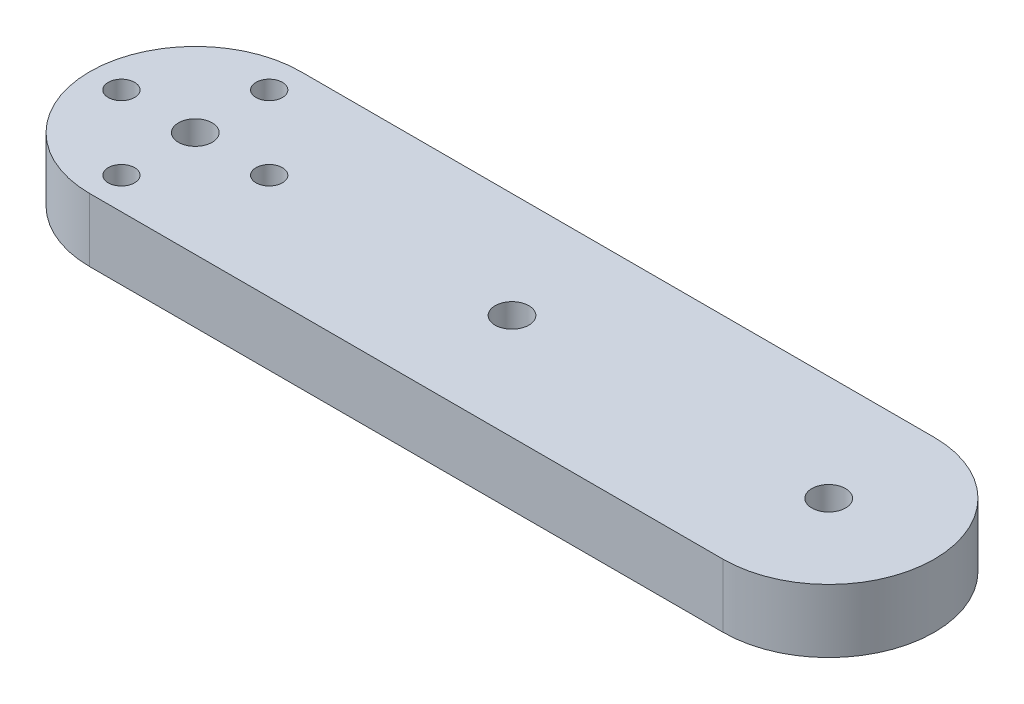
ISO-10303-21;
HEADER;
FILE_DESCRIPTION(('STEP AP214'),'2;1');
FILE_NAME('part.step','',(''),(''),'','','');
FILE_SCHEMA(('AUTOMOTIVE_DESIGN { 1 0 10303 214 1 1 1 1 }'));
ENDSEC;
DATA;
#1=APPLICATION_CONTEXT('core data for automotive mechanical design processes');
#2=APPLICATION_PROTOCOL_DEFINITION('international standard','automotive_design',2000,#1);
#3=PRODUCT_CONTEXT('',#1,'mechanical');
#4=PRODUCT('Part','Part','',(#3));
#5=PRODUCT_RELATED_PRODUCT_CATEGORY('part','',(#4));
#6=PRODUCT_DEFINITION_FORMATION('','',#4);
#7=PRODUCT_DEFINITION_CONTEXT('part definition',#1,'design');
#8=PRODUCT_DEFINITION('design','',#6,#7);
#9=PRODUCT_DEFINITION_SHAPE('','',#8);
#10=(LENGTH_UNIT() NAMED_UNIT(*) SI_UNIT(.MILLI.,.METRE.));
#11=(NAMED_UNIT(*) PLANE_ANGLE_UNIT() SI_UNIT($,.RADIAN.));
#12=(NAMED_UNIT(*) SI_UNIT($,.STERADIAN.) SOLID_ANGLE_UNIT());
#13=UNCERTAINTY_MEASURE_WITH_UNIT(LENGTH_MEASURE(1.E-05),#10,'distance_accuracy_value','');
#14=(GEOMETRIC_REPRESENTATION_CONTEXT(3) GLOBAL_UNCERTAINTY_ASSIGNED_CONTEXT((#13)) GLOBAL_UNIT_ASSIGNED_CONTEXT((#10,
#11,#12)) REPRESENTATION_CONTEXT('',''));
#15=CARTESIAN_POINT('',(0.,0.,0.));
#16=DIRECTION('',(0.,0.,1.));
#17=DIRECTION('',(1.,0.,0.));
#18=AXIS2_PLACEMENT_3D('',#15,#16,#17);
#19=CARTESIAN_POINT('',(0.,6.,-9.99999999999999));
#20=DIRECTION('',(0.,-1.,0.));
#21=DIRECTION('',(0.,0.,-1.));
#22=AXIS2_PLACEMENT_3D('',#19,#20,#21);
#23=PLANE('',#22);
#24=CARTESIAN_POINT('',(0.,6.,-9.99999999999999));
#25=DIRECTION('',(0.,1.,0.));
#26=DIRECTION('',(0.,0.,-1.));
#27=AXIS2_PLACEMENT_3D('',#24,#25,#26);
#28=CIRCLE('',#27,10.);
#29=CARTESIAN_POINT('',(0.,6.,0.));
#30=VERTEX_POINT('',#29);
#31=CARTESIAN_POINT('',(0.,6.,-20.));
#32=VERTEX_POINT('',#31);
#33=EDGE_CURVE('E86',#30,#32,#28,.T.);
#34=ORIENTED_EDGE('',*,*,#33,.T.);
#35=DIRECTION('',(-1.,0.,0.));
#36=VECTOR('',#35,1.);
#37=CARTESIAN_POINT('',(0.,6.,-20.));
#38=LINE('',#37,#36);
#39=CARTESIAN_POINT('',(-60.,6.,-20.));
#40=VERTEX_POINT('',#39);
#41=EDGE_CURVE('E81',#32,#40,#38,.T.);
#42=ORIENTED_EDGE('',*,*,#41,.T.);
#43=CARTESIAN_POINT('',(-60.,6.,-10.));
#44=DIRECTION('',(0.,1.,0.));
#45=DIRECTION('',(0.,0.,1.));
#46=AXIS2_PLACEMENT_3D('',#43,#44,#45);
#47=CIRCLE('',#46,10.);
#48=CARTESIAN_POINT('',(-60.,6.,0.));
#49=VERTEX_POINT('',#48);
#50=EDGE_CURVE('E84',#40,#49,#47,.T.);
#51=ORIENTED_EDGE('',*,*,#50,.T.);
#52=DIRECTION('',(1.,0.,0.));
#53=VECTOR('',#52,1.);
#54=CARTESIAN_POINT('',(0.,6.,0.));
#55=LINE('',#54,#53);
#56=EDGE_CURVE('E51',#49,#30,#55,.T.);
#57=ORIENTED_EDGE('',*,*,#56,.T.);
#58=EDGE_LOOP('',(#34,#42,#51,#57));
#59=FACE_BOUND('',#58,.T.);
#60=CARTESIAN_POINT('',(-60.,6.,-10.));
#61=DIRECTION('',(0.,1.,0.));
#62=DIRECTION('',(0.,0.,1.));
#63=AXIS2_PLACEMENT_3D('',#60,#61,#62);
#64=CIRCLE('',#63,1.6);
#65=CARTESIAN_POINT('',(-60.,6.,-8.4));
#66=VERTEX_POINT('',#65);
#67=EDGE_CURVE('E101',#66,#66,#64,.T.);
#68=ORIENTED_EDGE('',*,*,#67,.F.);
#69=EDGE_LOOP('',(#68));
#70=FACE_BOUND('',#69,.T.);
#71=CARTESIAN_POINT('',(-60.,6.,-17.));
#72=DIRECTION('',(0.,1.,0.));
#73=DIRECTION('',(0.,0.,1.));
#74=AXIS2_PLACEMENT_3D('',#71,#72,#73);
#75=CIRCLE('',#74,1.25);
#76=CARTESIAN_POINT('',(-60.,6.,-15.75));
#77=VERTEX_POINT('',#76);
#78=EDGE_CURVE('E116',#77,#77,#75,.T.);
#79=ORIENTED_EDGE('',*,*,#78,.F.);
#80=EDGE_LOOP('',(#79));
#81=FACE_BOUND('',#80,.T.);
#82=CARTESIAN_POINT('',(-60.,6.,-3.));
#83=DIRECTION('',(0.,1.,0.));
#84=DIRECTION('',(0.,0.,-1.));
#85=AXIS2_PLACEMENT_3D('',#82,#83,#84);
#86=CIRCLE('',#85,1.25);
#87=CARTESIAN_POINT('',(-60.,6.,-4.25));
#88=VERTEX_POINT('',#87);
#89=EDGE_CURVE('E122',#88,#88,#86,.T.);
#90=ORIENTED_EDGE('',*,*,#89,.F.);
#91=EDGE_LOOP('',(#90));
#92=FACE_BOUND('',#91,.T.);
#93=CARTESIAN_POINT('',(-67.,6.,-10.));
#94=DIRECTION('',(0.,1.,0.));
#95=DIRECTION('',(0.,0.,1.));
#96=AXIS2_PLACEMENT_3D('',#93,#94,#95);
#97=CIRCLE('',#96,1.25);
#98=CARTESIAN_POINT('',(-67.,6.,-8.75));
#99=VERTEX_POINT('',#98);
#100=EDGE_CURVE('E128',#99,#99,#97,.T.);
#101=ORIENTED_EDGE('',*,*,#100,.F.);
#102=EDGE_LOOP('',(#101));
#103=FACE_BOUND('',#102,.T.);
#104=CARTESIAN_POINT('',(-53.,6.,-10.));
#105=DIRECTION('',(0.,1.,0.));
#106=DIRECTION('',(0.,0.,-1.));
#107=AXIS2_PLACEMENT_3D('',#104,#105,#106);
#108=CIRCLE('',#107,1.25);
#109=CARTESIAN_POINT('',(-53.,6.,-11.25));
#110=VERTEX_POINT('',#109);
#111=EDGE_CURVE('E134',#110,#110,#108,.T.);
#112=ORIENTED_EDGE('',*,*,#111,.F.);
#113=EDGE_LOOP('',(#112));
#114=FACE_BOUND('',#113,.T.);
#115=CARTESIAN_POINT('',(0.,6.,-9.99999999999999));
#116=DIRECTION('',(0.,1.,0.));
#117=DIRECTION('',(0.,0.,-1.));
#118=AXIS2_PLACEMENT_3D('',#115,#116,#117);
#119=CIRCLE('',#118,1.6);
#120=CARTESIAN_POINT('',(0.,6.,-11.6));
#121=VERTEX_POINT('',#120);
#122=EDGE_CURVE('E140',#121,#121,#119,.T.);
#123=ORIENTED_EDGE('',*,*,#122,.F.);
#124=EDGE_LOOP('',(#123));
#125=FACE_BOUND('',#124,.T.);
#126=CARTESIAN_POINT('',(-30.,6.,-10.));
#127=DIRECTION('',(0.,1.,0.));
#128=DIRECTION('',(0.,0.,1.));
#129=AXIS2_PLACEMENT_3D('',#126,#127,#128);
#130=CIRCLE('',#129,1.6);
#131=CARTESIAN_POINT('',(-30.,6.,-8.4));
#132=VERTEX_POINT('',#131);
#133=EDGE_CURVE('E146',#132,#132,#130,.T.);
#134=ORIENTED_EDGE('',*,*,#133,.F.);
#135=EDGE_LOOP('',(#134));
#136=FACE_BOUND('',#135,.T.);
#137=ADVANCED_FACE('F34',(#59,#70,#81,#92,#103,#114,#125,#136),#23,.F.);
#138=CARTESIAN_POINT('',(0.,0.,-9.99999999999999));
#139=DIRECTION('',(0.,-1.,0.));
#140=DIRECTION('',(0.,0.,-1.));
#141=AXIS2_PLACEMENT_3D('',#138,#139,#140);
#142=PLANE('',#141);
#143=CARTESIAN_POINT('',(0.,0.,-9.99999999999999));
#144=DIRECTION('',(0.,1.,0.));
#145=DIRECTION('',(0.,0.,-1.));
#146=AXIS2_PLACEMENT_3D('',#143,#144,#145);
#147=CIRCLE('',#146,1.6);
#148=CARTESIAN_POINT('',(0.,0.,-11.6));
#149=VERTEX_POINT('',#148);
#150=EDGE_CURVE('E143',#149,#149,#147,.T.);
#151=ORIENTED_EDGE('',*,*,#150,.T.);
#152=EDGE_LOOP('',(#151));
#153=FACE_BOUND('',#152,.T.);
#154=CARTESIAN_POINT('',(-67.,0.,-10.));
#155=DIRECTION('',(0.,1.,0.));
#156=DIRECTION('',(0.,0.,1.));
#157=AXIS2_PLACEMENT_3D('',#154,#155,#156);
#158=CIRCLE('',#157,1.25);
#159=CARTESIAN_POINT('',(-67.,0.,-8.75));
#160=VERTEX_POINT('',#159);
#161=EDGE_CURVE('E131',#160,#160,#158,.T.);
#162=ORIENTED_EDGE('',*,*,#161,.T.);
#163=EDGE_LOOP('',(#162));
#164=FACE_BOUND('',#163,.T.);
#165=CARTESIAN_POINT('',(-60.,0.,-17.));
#166=DIRECTION('',(0.,1.,0.));
#167=DIRECTION('',(0.,0.,1.));
#168=AXIS2_PLACEMENT_3D('',#165,#166,#167);
#169=CIRCLE('',#168,1.25);
#170=CARTESIAN_POINT('',(-60.,0.,-15.75));
#171=VERTEX_POINT('',#170);
#172=EDGE_CURVE('E119',#171,#171,#169,.T.);
#173=ORIENTED_EDGE('',*,*,#172,.T.);
#174=EDGE_LOOP('',(#173));
#175=FACE_BOUND('',#174,.T.);
#176=CARTESIAN_POINT('',(0.,0.,-9.99999999999999));
#177=DIRECTION('',(0.,1.,0.));
#178=DIRECTION('',(0.,0.,-1.));
#179=AXIS2_PLACEMENT_3D('',#176,#177,#178);
#180=CIRCLE('',#179,10.);
#181=CARTESIAN_POINT('',(0.,0.,0.));
#182=VERTEX_POINT('',#181);
#183=CARTESIAN_POINT('',(0.,0.,-20.));
#184=VERTEX_POINT('',#183);
#185=EDGE_CURVE('E98',#182,#184,#180,.T.);
#186=ORIENTED_EDGE('',*,*,#185,.F.);
#187=DIRECTION('',(1.,0.,0.));
#188=VECTOR('',#187,1.);
#189=CARTESIAN_POINT('',(0.,0.,0.));
#190=LINE('',#189,#188);
#191=CARTESIAN_POINT('',(-60.,0.,0.));
#192=VERTEX_POINT('',#191);
#193=EDGE_CURVE('E74',#192,#182,#190,.T.);
#194=ORIENTED_EDGE('',*,*,#193,.F.);
#195=CARTESIAN_POINT('',(-60.,0.,-10.));
#196=DIRECTION('',(0.,1.,0.));
#197=DIRECTION('',(0.,0.,1.));
#198=AXIS2_PLACEMENT_3D('',#195,#196,#197);
#199=CIRCLE('',#198,10.);
#200=CARTESIAN_POINT('',(-60.,0.,-20.));
#201=VERTEX_POINT('',#200);
#202=EDGE_CURVE('E68',#201,#192,#199,.T.);
#203=ORIENTED_EDGE('',*,*,#202,.F.);
#204=DIRECTION('',(-1.,0.,0.));
#205=VECTOR('',#204,1.);
#206=CARTESIAN_POINT('',(0.,0.,-20.));
#207=LINE('',#206,#205);
#208=EDGE_CURVE('E90',#184,#201,#207,.T.);
#209=ORIENTED_EDGE('',*,*,#208,.F.);
#210=EDGE_LOOP('',(#186,#194,#203,#209));
#211=FACE_BOUND('',#210,.T.);
#212=CARTESIAN_POINT('',(-60.,0.,-10.));
#213=DIRECTION('',(0.,1.,0.));
#214=DIRECTION('',(0.,0.,1.));
#215=AXIS2_PLACEMENT_3D('',#212,#213,#214);
#216=CIRCLE('',#215,1.6);
#217=CARTESIAN_POINT('',(-60.,0.,-8.4));
#218=VERTEX_POINT('',#217);
#219=EDGE_CURVE('E113',#218,#218,#216,.T.);
#220=ORIENTED_EDGE('',*,*,#219,.T.);
#221=EDGE_LOOP('',(#220));
#222=FACE_BOUND('',#221,.T.);
#223=CARTESIAN_POINT('',(-60.,0.,-3.));
#224=DIRECTION('',(0.,1.,0.));
#225=DIRECTION('',(0.,0.,-1.));
#226=AXIS2_PLACEMENT_3D('',#223,#224,#225);
#227=CIRCLE('',#226,1.25);
#228=CARTESIAN_POINT('',(-60.,0.,-4.25));
#229=VERTEX_POINT('',#228);
#230=EDGE_CURVE('E125',#229,#229,#227,.T.);
#231=ORIENTED_EDGE('',*,*,#230,.T.);
#232=EDGE_LOOP('',(#231));
#233=FACE_BOUND('',#232,.T.);
#234=CARTESIAN_POINT('',(-53.,0.,-10.));
#235=DIRECTION('',(0.,1.,0.));
#236=DIRECTION('',(0.,0.,-1.));
#237=AXIS2_PLACEMENT_3D('',#234,#235,#236);
#238=CIRCLE('',#237,1.25);
#239=CARTESIAN_POINT('',(-53.,0.,-11.25));
#240=VERTEX_POINT('',#239);
#241=EDGE_CURVE('E137',#240,#240,#238,.T.);
#242=ORIENTED_EDGE('',*,*,#241,.T.);
#243=EDGE_LOOP('',(#242));
#244=FACE_BOUND('',#243,.T.);
#245=CARTESIAN_POINT('',(-30.,0.,-10.));
#246=DIRECTION('',(0.,1.,0.));
#247=DIRECTION('',(0.,0.,1.));
#248=AXIS2_PLACEMENT_3D('',#245,#246,#247);
#249=CIRCLE('',#248,1.6);
#250=CARTESIAN_POINT('',(-30.,0.,-8.4));
#251=VERTEX_POINT('',#250);
#252=EDGE_CURVE('E149',#251,#251,#249,.T.);
#253=ORIENTED_EDGE('',*,*,#252,.T.);
#254=EDGE_LOOP('',(#253));
#255=FACE_BOUND('',#254,.T.);
#256=ADVANCED_FACE('F109',(#153,#164,#175,#211,#222,#233,#244,#255),#142,.T.);
#257=CARTESIAN_POINT('',(0.,6.,-9.99999999999999));
#258=DIRECTION('',(0.,-1.,0.));
#259=DIRECTION('',(0.,0.,-1.));
#260=AXIS2_PLACEMENT_3D('',#257,#258,#259);
#261=CYLINDRICAL_SURFACE('',#260,10.);
#262=ORIENTED_EDGE('',*,*,#185,.T.);
#263=DIRECTION('',(0.,-1.,0.));
#264=VECTOR('',#263,1.);
#265=CARTESIAN_POINT('',(0.,6.,-20.));
#266=LINE('',#265,#264);
#267=EDGE_CURVE('E11',#32,#184,#266,.T.);
#268=ORIENTED_EDGE('',*,*,#267,.F.);
#269=ORIENTED_EDGE('',*,*,#33,.F.);
#270=DIRECTION('',(0.,-1.,0.));
#271=VECTOR('',#270,1.);
#272=CARTESIAN_POINT('',(0.,6.,0.));
#273=LINE('',#272,#271);
#274=EDGE_CURVE('E94',#30,#182,#273,.T.);
#275=ORIENTED_EDGE('',*,*,#274,.T.);
#276=EDGE_LOOP('',(#262,#268,#269,#275));
#277=FACE_BOUND('',#276,.T.);
#278=ADVANCED_FACE('F36',(#277),#261,.T.);
#279=CARTESIAN_POINT('',(0.,6.,-20.));
#280=DIRECTION('',(0.,0.,1.));
#281=DIRECTION('',(1.,0.,0.));
#282=AXIS2_PLACEMENT_3D('',#279,#280,#281);
#283=PLANE('',#282);
#284=ORIENTED_EDGE('',*,*,#208,.T.);
#285=DIRECTION('',(0.,-1.,0.));
#286=VECTOR('',#285,1.);
#287=CARTESIAN_POINT('',(-60.,6.,-20.));
#288=LINE('',#287,#286);
#289=EDGE_CURVE('E43',#40,#201,#288,.T.);
#290=ORIENTED_EDGE('',*,*,#289,.F.);
#291=ORIENTED_EDGE('',*,*,#41,.F.);
#292=ORIENTED_EDGE('',*,*,#267,.T.);
#293=EDGE_LOOP('',(#284,#290,#291,#292));
#294=FACE_BOUND('',#293,.T.);
#295=ADVANCED_FACE('F89',(#294),#283,.F.);
#296=CARTESIAN_POINT('',(-60.,6.,-10.));
#297=DIRECTION('',(0.,-1.,0.));
#298=DIRECTION('',(0.,0.,-1.));
#299=AXIS2_PLACEMENT_3D('',#296,#297,#298);
#300=CYLINDRICAL_SURFACE('',#299,10.);
#301=ORIENTED_EDGE('',*,*,#202,.T.);
#302=DIRECTION('',(0.,-1.,0.));
#303=VECTOR('',#302,1.);
#304=CARTESIAN_POINT('',(-60.,6.,0.));
#305=LINE('',#304,#303);
#306=EDGE_CURVE('E91',#49,#192,#305,.T.);
#307=ORIENTED_EDGE('',*,*,#306,.F.);
#308=ORIENTED_EDGE('',*,*,#50,.F.);
#309=ORIENTED_EDGE('',*,*,#289,.T.);
#310=EDGE_LOOP('',(#301,#307,#308,#309));
#311=FACE_BOUND('',#310,.T.);
#312=ADVANCED_FACE('F92',(#311),#300,.T.);
#313=CARTESIAN_POINT('',(0.,6.,0.));
#314=DIRECTION('',(0.,0.,-1.));
#315=DIRECTION('',(-1.,0.,0.));
#316=AXIS2_PLACEMENT_3D('',#313,#314,#315);
#317=PLANE('',#316);
#318=ORIENTED_EDGE('',*,*,#193,.T.);
#319=ORIENTED_EDGE('',*,*,#274,.F.);
#320=ORIENTED_EDGE('',*,*,#56,.F.);
#321=ORIENTED_EDGE('',*,*,#306,.T.);
#322=EDGE_LOOP('',(#318,#319,#320,#321));
#323=FACE_BOUND('',#322,.T.);
#324=ADVANCED_FACE('F106',(#323),#317,.F.);
#325=CARTESIAN_POINT('',(-60.,6.,-10.));
#326=DIRECTION('',(0.,-1.,0.));
#327=DIRECTION('',(0.,0.,-1.));
#328=AXIS2_PLACEMENT_3D('',#325,#326,#327);
#329=CYLINDRICAL_SURFACE('',#328,1.6);
#330=ORIENTED_EDGE('',*,*,#67,.T.);
#331=EDGE_LOOP('',(#330));
#332=FACE_BOUND('',#331,.T.);
#333=ORIENTED_EDGE('',*,*,#219,.F.);
#334=EDGE_LOOP('',(#333));
#335=FACE_BOUND('',#334,.T.);
#336=ADVANCED_FACE('F166',(#332,#335),#329,.F.);
#337=CARTESIAN_POINT('',(-60.,6.,-17.));
#338=DIRECTION('',(0.,-1.,0.));
#339=DIRECTION('',(0.,0.,-1.));
#340=AXIS2_PLACEMENT_3D('',#337,#338,#339);
#341=CYLINDRICAL_SURFACE('',#340,1.25);
#342=ORIENTED_EDGE('',*,*,#78,.T.);
#343=EDGE_LOOP('',(#342));
#344=FACE_BOUND('',#343,.T.);
#345=ORIENTED_EDGE('',*,*,#172,.F.);
#346=EDGE_LOOP('',(#345));
#347=FACE_BOUND('',#346,.T.);
#348=ADVANCED_FACE('F212',(#344,#347),#341,.F.);
#349=CARTESIAN_POINT('',(-60.,6.,-3.));
#350=DIRECTION('',(0.,-1.,0.));
#351=DIRECTION('',(0.,0.,-1.));
#352=AXIS2_PLACEMENT_3D('',#349,#350,#351);
#353=CYLINDRICAL_SURFACE('',#352,1.25);
#354=ORIENTED_EDGE('',*,*,#89,.T.);
#355=EDGE_LOOP('',(#354));
#356=FACE_BOUND('',#355,.T.);
#357=ORIENTED_EDGE('',*,*,#230,.F.);
#358=EDGE_LOOP('',(#357));
#359=FACE_BOUND('',#358,.T.);
#360=ADVANCED_FACE('F220',(#356,#359),#353,.F.);
#361=CARTESIAN_POINT('',(-67.,6.,-10.));
#362=DIRECTION('',(0.,-1.,0.));
#363=DIRECTION('',(0.,0.,-1.));
#364=AXIS2_PLACEMENT_3D('',#361,#362,#363);
#365=CYLINDRICAL_SURFACE('',#364,1.25);
#366=ORIENTED_EDGE('',*,*,#100,.T.);
#367=EDGE_LOOP('',(#366));
#368=FACE_BOUND('',#367,.T.);
#369=ORIENTED_EDGE('',*,*,#161,.F.);
#370=EDGE_LOOP('',(#369));
#371=FACE_BOUND('',#370,.T.);
#372=ADVANCED_FACE('F228',(#368,#371),#365,.F.);
#373=CARTESIAN_POINT('',(-53.,6.,-10.));
#374=DIRECTION('',(0.,-1.,0.));
#375=DIRECTION('',(0.,0.,-1.));
#376=AXIS2_PLACEMENT_3D('',#373,#374,#375);
#377=CYLINDRICAL_SURFACE('',#376,1.25);
#378=ORIENTED_EDGE('',*,*,#111,.T.);
#379=EDGE_LOOP('',(#378));
#380=FACE_BOUND('',#379,.T.);
#381=ORIENTED_EDGE('',*,*,#241,.F.);
#382=EDGE_LOOP('',(#381));
#383=FACE_BOUND('',#382,.T.);
#384=ADVANCED_FACE('F237',(#380,#383),#377,.F.);
#385=CARTESIAN_POINT('',(0.,6.,-9.99999999999999));
#386=DIRECTION('',(0.,-1.,0.));
#387=DIRECTION('',(0.,0.,-1.));
#388=AXIS2_PLACEMENT_3D('',#385,#386,#387);
#389=CYLINDRICAL_SURFACE('',#388,1.6);
#390=ORIENTED_EDGE('',*,*,#122,.T.);
#391=EDGE_LOOP('',(#390));
#392=FACE_BOUND('',#391,.T.);
#393=ORIENTED_EDGE('',*,*,#150,.F.);
#394=EDGE_LOOP('',(#393));
#395=FACE_BOUND('',#394,.T.);
#396=ADVANCED_FACE('F246',(#392,#395),#389,.F.);
#397=CARTESIAN_POINT('',(-30.,6.,-10.));
#398=DIRECTION('',(0.,-1.,0.));
#399=DIRECTION('',(0.,0.,-1.));
#400=AXIS2_PLACEMENT_3D('',#397,#398,#399);
#401=CYLINDRICAL_SURFACE('',#400,1.6);
#402=ORIENTED_EDGE('',*,*,#133,.T.);
#403=EDGE_LOOP('',(#402));
#404=FACE_BOUND('',#403,.T.);
#405=ORIENTED_EDGE('',*,*,#252,.F.);
#406=EDGE_LOOP('',(#405));
#407=FACE_BOUND('',#406,.T.);
#408=ADVANCED_FACE('F155',(#404,#407),#401,.F.);
#409=CLOSED_SHELL('',(#137,#256,#278,#295,#312,#324,#336,#348,#360,#372,#384,#396,#408));
#410=MANIFOLD_SOLID_BREP('B2',#409);
#411=ADVANCED_BREP_SHAPE_REPRESENTATION('',(#18,#410),#14);
#412=SHAPE_DEFINITION_REPRESENTATION(#9,#411);
ENDSEC;
END-ISO-10303-21;
